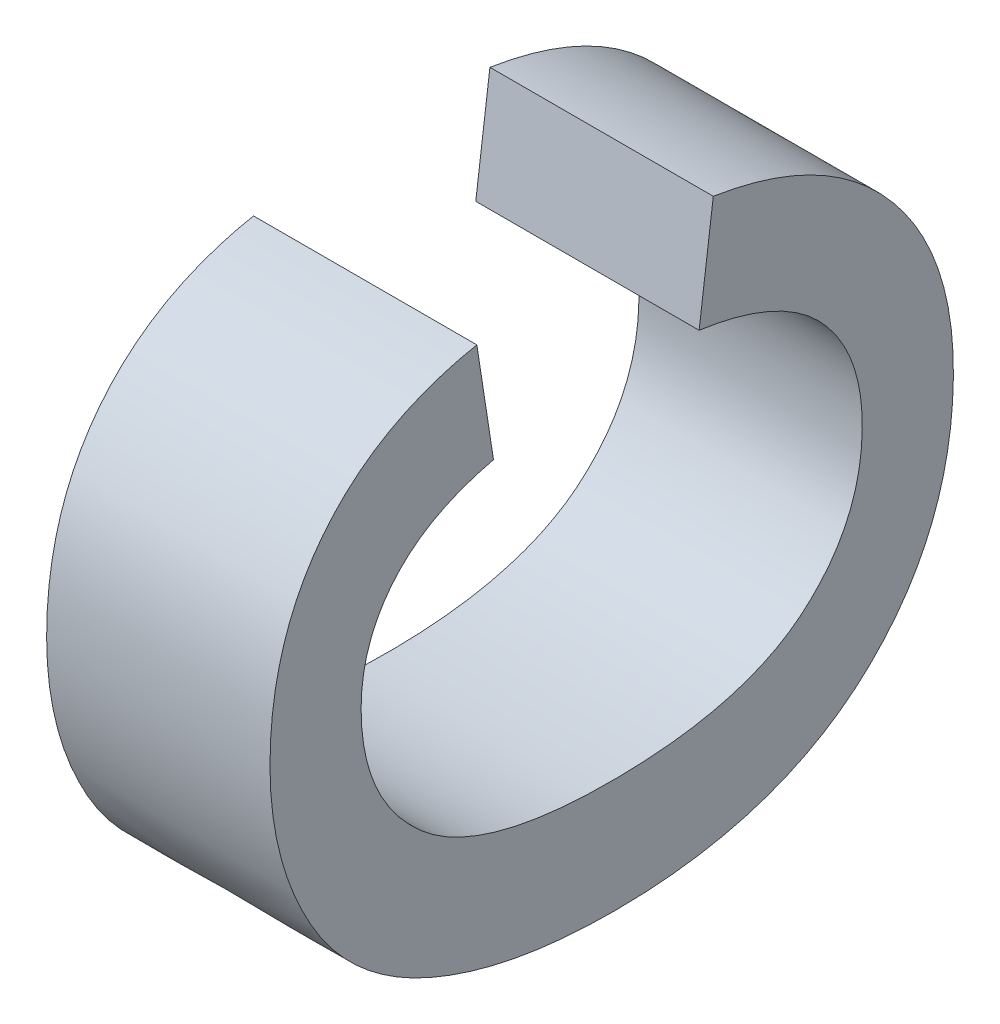
ISO-10303-21;
HEADER;
FILE_DESCRIPTION(('STEP AP214'),'2;1');
FILE_NAME('part.step','',(''),(''),'','','');
FILE_SCHEMA(('AUTOMOTIVE_DESIGN { 1 0 10303 214 1 1 1 1 }'));
ENDSEC;
DATA;
#1=APPLICATION_CONTEXT('core data for automotive mechanical design processes');
#2=APPLICATION_PROTOCOL_DEFINITION('international standard','automotive_design',2000,#1);
#3=PRODUCT_CONTEXT('',#1,'mechanical');
#4=PRODUCT('Part','Part','',(#3));
#5=PRODUCT_RELATED_PRODUCT_CATEGORY('part','',(#4));
#6=PRODUCT_DEFINITION_FORMATION('','',#4);
#7=PRODUCT_DEFINITION_CONTEXT('part definition',#1,'design');
#8=PRODUCT_DEFINITION('design','',#6,#7);
#9=PRODUCT_DEFINITION_SHAPE('','',#8);
#10=(LENGTH_UNIT() NAMED_UNIT(*) SI_UNIT(.MILLI.,.METRE.));
#11=(NAMED_UNIT(*) PLANE_ANGLE_UNIT() SI_UNIT($,.RADIAN.));
#12=(NAMED_UNIT(*) SI_UNIT($,.STERADIAN.) SOLID_ANGLE_UNIT());
#13=UNCERTAINTY_MEASURE_WITH_UNIT(LENGTH_MEASURE(1.E-05),#10,'distance_accuracy_value','');
#14=(GEOMETRIC_REPRESENTATION_CONTEXT(3) GLOBAL_UNCERTAINTY_ASSIGNED_CONTEXT((#13)) GLOBAL_UNIT_ASSIGNED_CONTEXT((#10,
#11,#12)) REPRESENTATION_CONTEXT('',''));
#15=CARTESIAN_POINT('',(0.,0.,0.));
#16=DIRECTION('',(0.,0.,1.));
#17=DIRECTION('',(1.,0.,0.));
#18=AXIS2_PLACEMENT_3D('',#15,#16,#17);
#19=CARTESIAN_POINT('',(4.55229940712924,-40.0797954372396,-8.85443015768737));
#20=DIRECTION('',(-1.,0.,0.));
#21=DIRECTION('',(0.,0.,1.));
#22=AXIS2_PLACEMENT_3D('',#19,#20,#21);
#23=PLANE('',#22);
#24=CARTESIAN_POINT('',(4.55229940712921,-39.8220421062064,-9.00542493597448));
#25=CARTESIAN_POINT('',(4.55229940712921,-39.8461617924584,-9.00914625899622));
#26=CARTESIAN_POINT('',(4.55229940712921,-39.8702814787103,-9.01286758201795));
#27=(BOUNDED_CURVE() B_SPLINE_CURVE(2,(#24,#25,#26),.UNSPECIFIED.,.F.,
.F.) B_SPLINE_CURVE_WITH_KNOTS((3,3),(37.,38.),
.UNSPECIFIED.) CURVE() GEOMETRIC_REPRESENTATION_ITEM() RATIONAL_B_SPLINE_CURVE((1.,1.,1.)) REPRESENTATION_ITEM(''));
#28=CARTESIAN_POINT('',(4.55229940712921,-39.8220421062064,-9.00542493597448));
#29=VERTEX_POINT('',#28);
#30=CARTESIAN_POINT('',(4.55229940712921,-39.8702814787103,-9.01286758201795));
#31=VERTEX_POINT('',#30);
#32=EDGE_CURVE('E87',#29,#31,#27,.T.);
#33=ORIENTED_EDGE('',*,*,#32,.T.);
#34=CARTESIAN_POINT('',(4.55229940712921,-39.8702814787103,-9.01286758201795));
#35=CARTESIAN_POINT('',(4.55229940712921,-39.8771728176395,-8.98337265140124));
#36=CARTESIAN_POINT('',(4.55229940712922,-39.8946768185195,-8.9684873593143));
#37=CARTESIAN_POINT('',(4.55229940712922,-39.9121808193995,-8.95360206722737));
#38=CARTESIAN_POINT('',(4.55229940712922,-39.9369896395444,-8.95360206722737));
#39=CARTESIAN_POINT('',(4.55229940712923,-39.9744785233189,-8.95360206722737));
#40=CARTESIAN_POINT('',(4.55229940712923,-39.997909075678,-8.980478289051));
#41=CARTESIAN_POINT('',(4.55229940712923,-40.0213396280371,-9.00735451087464));
#42=CARTESIAN_POINT('',(4.55229940712923,-40.0213396280371,-9.06551741143657));
#43=CARTESIAN_POINT('',(4.55229940712923,-40.0213396280371,-9.12450727267));
#44=CARTESIAN_POINT('',(4.55229940712923,-39.9987360363495,-9.15124566771505));
#45=CARTESIAN_POINT('',(4.55229940712923,-39.9761324446619,-9.17798406276012));
#46=CARTESIAN_POINT('',(4.55229940712922,-39.9397461751161,-9.17798406276011));
#47=CARTESIAN_POINT('',(4.55229940712922,-39.9105268980565,-9.17798406276012));
#48=CARTESIAN_POINT('',(4.55229940712922,-39.8909554954978,-9.16006658154435));
#49=CARTESIAN_POINT('',(4.55229940712921,-39.871384092939,-9.14214910032859));
#50=CARTESIAN_POINT('',(4.55229940712921,-39.8661466753529,-9.10493587011124));
#51=(BOUNDED_CURVE() B_SPLINE_CURVE(2,(#34,#35,#36,#37,#38,#39,#40,#41,#42,#43,#44,#45,#46,#47,
#48,#49,#50),.UNSPECIFIED.,.F.,.F.) B_SPLINE_CURVE_WITH_KNOTS((3,2,2,2,2,2,2,2,3),(38.,39.,40.,
41.,42.,43.,44.,45.,46.),
.UNSPECIFIED.) CURVE() GEOMETRIC_REPRESENTATION_ITEM() RATIONAL_B_SPLINE_CURVE((1.,1.,1.,1.,1.,
1.,1.,1.,1.,1.,1.,1.,1.,1.,1.,1.,1.)) REPRESENTATION_ITEM(''));
#52=CARTESIAN_POINT('',(4.55229940712921,-39.8661466753529,-9.10493587011124));
#53=VERTEX_POINT('',#52);
#54=EDGE_CURVE('E85',#31,#53,#51,.T.);
#55=ORIENTED_EDGE('',*,*,#54,.T.);
#56=CARTESIAN_POINT('',(4.55229940712921,-39.8661466753529,-9.10493587011124));
#57=CARTESIAN_POINT('',(4.55229940712921,-39.8417513355437,-9.10810588601865));
#58=CARTESIAN_POINT('',(4.5522994071292,-39.8173559957346,-9.11127590192605));
#59=(BOUNDED_CURVE() B_SPLINE_CURVE(2,(#56,#57,#58),.UNSPECIFIED.,.F.,
.F.) B_SPLINE_CURVE_WITH_KNOTS((3,3),(46.,47.),
.UNSPECIFIED.) CURVE() GEOMETRIC_REPRESENTATION_ITEM() RATIONAL_B_SPLINE_CURVE((1.,1.,1.)) REPRESENTATION_ITEM(''));
#60=CARTESIAN_POINT('',(4.5522994071292,-39.8173559957346,-9.11127590192605));
#61=VERTEX_POINT('',#60);
#62=EDGE_CURVE('E76',#53,#61,#59,.T.);
#63=ORIENTED_EDGE('',*,*,#62,.T.);
#64=CARTESIAN_POINT('',(4.5522994071292,-39.8173559957346,-9.11127590192605));
#65=CARTESIAN_POINT('',(4.55229940712921,-39.8253499488924,-9.16172050288735));
#66=CARTESIAN_POINT('',(4.55229940712921,-39.8582905489736,-9.19025064605398));
#67=CARTESIAN_POINT('',(4.55229940712921,-39.8912311490549,-9.21878078922061));
#68=CARTESIAN_POINT('',(4.55229940712922,-39.9391948680017,-9.21878078922061));
#69=CARTESIAN_POINT('',(4.55229940712923,-39.9992873434638,-9.21878078922061));
#70=CARTESIAN_POINT('',(4.55229940712924,-40.0358114397882,-9.17950015732453));
#71=CARTESIAN_POINT('',(4.55229940712924,-40.0723355361127,-9.14021952542843));
#72=CARTESIAN_POINT('',(4.55229940712924,-40.0723355361127,-9.0668956792224));
#73=CARTESIAN_POINT('',(4.55229940712924,-40.0723355361127,-9.01948326738993));
#74=CARTESIAN_POINT('',(4.55229940712924,-40.0566232833543,-8.98392395851557));
#75=CARTESIAN_POINT('',(4.55229940712924,-40.0409110305958,-8.94836464964122));
#76=CARTESIAN_POINT('',(4.55229940712923,-40.008797391186,-8.93058499520405));
#77=CARTESIAN_POINT('',(4.55229940712923,-39.9766837517763,-8.91280534076686));
#78=CARTESIAN_POINT('',(4.55229940712922,-39.9389192144446,-8.91280534076686));
#79=CARTESIAN_POINT('',(4.55229940712922,-39.8912311490549,-8.91280534076686));
#80=CARTESIAN_POINT('',(4.55229940712921,-39.8609092577667,-8.93692502701885));
#81=CARTESIAN_POINT('',(4.55229940712921,-39.8305874001276,-8.96104471327084));
#82=CARTESIAN_POINT('',(4.55229940712921,-39.8220421062064,-9.00542493597448));
#83=(BOUNDED_CURVE() B_SPLINE_CURVE(2,(#64,#65,#66,#67,#68,#69,#70,#71,#72,#73,#74,#75,#76,#77,
#78,#79,#80,#81,#82),.UNSPECIFIED.,.F.,.F.) B_SPLINE_CURVE_WITH_KNOTS((3,2,2,2,2,2,2,2,2,3),
(47.,48.,49.,50.,51.,52.,53.,54.,55.,56.),
.UNSPECIFIED.) CURVE() GEOMETRIC_REPRESENTATION_ITEM() RATIONAL_B_SPLINE_CURVE((1.,1.,1.,1.,1.,
1.,1.,1.,1.,1.,1.,1.,1.,1.,1.,1.,1.,1.,1.)) REPRESENTATION_ITEM(''));
#84=EDGE_CURVE('E11',#61,#29,#83,.T.);
#85=ORIENTED_EDGE('',*,*,#84,.T.);
#86=EDGE_LOOP('',(#33,#55,#63,#85));
#87=FACE_BOUND('',#86,.T.);
#88=ADVANCED_FACE('F16',(#87),#23,.T.);
#89=CARTESIAN_POINT('',(4.65229940712925,-40.0797954372396,-8.85443015768737));
#90=DIRECTION('',(1.,0.,0.));
#91=DIRECTION('',(0.,1.,0.));
#92=AXIS2_PLACEMENT_3D('',#89,#90,#91);
#93=PLANE('',#92);
#94=CARTESIAN_POINT('',(4.65229940712921,-39.8173559957346,-9.11127590192605));
#95=CARTESIAN_POINT('',(4.65229940712921,-39.8253499488924,-9.16172050288735));
#96=CARTESIAN_POINT('',(4.65229940712921,-39.8582905489736,-9.19025064605398));
#97=CARTESIAN_POINT('',(4.65229940712922,-39.8912311490549,-9.21878078922061));
#98=CARTESIAN_POINT('',(4.65229940712922,-39.9391948680017,-9.21878078922062));
#99=CARTESIAN_POINT('',(4.65229940712923,-39.9992873434638,-9.21878078922061));
#100=CARTESIAN_POINT('',(4.65229940712924,-40.0358114397882,-9.17950015732453));
#101=CARTESIAN_POINT('',(4.65229940712924,-40.0723355361127,-9.14021952542844));
#102=CARTESIAN_POINT('',(4.65229940712924,-40.0723355361127,-9.0668956792224));
#103=CARTESIAN_POINT('',(4.65229940712924,-40.0723355361127,-9.01948326738993));
#104=CARTESIAN_POINT('',(4.65229940712924,-40.0566232833542,-8.98392395851557));
#105=CARTESIAN_POINT('',(4.65229940712924,-40.0409110305958,-8.94836464964122));
#106=CARTESIAN_POINT('',(4.65229940712924,-40.008797391186,-8.93058499520405));
#107=CARTESIAN_POINT('',(4.65229940712923,-39.9766837517762,-8.91280534076686));
#108=CARTESIAN_POINT('',(4.65229940712923,-39.9389192144445,-8.91280534076686));
#109=CARTESIAN_POINT('',(4.65229940712922,-39.8912311490549,-8.91280534076686));
#110=CARTESIAN_POINT('',(4.65229940712921,-39.8609092577667,-8.93692502701885));
#111=CARTESIAN_POINT('',(4.65229940712921,-39.8305874001276,-8.96104471327084));
#112=CARTESIAN_POINT('',(4.65229940712921,-39.8220421062064,-9.00542493597448));
#113=(BOUNDED_CURVE() B_SPLINE_CURVE(2,(#94,#95,#96,#97,#98,#99,#100,#101,#102,#103,#104,#105,
#106,#107,#108,#109,#110,#111,#112),.UNSPECIFIED.,.F.,.F.) B_SPLINE_CURVE_WITH_KNOTS((3,2,2,2,2,
2,2,2,2,3),(47.,48.,49.,50.,51.,52.,53.,54.,55.,56.),
.UNSPECIFIED.) CURVE() GEOMETRIC_REPRESENTATION_ITEM() RATIONAL_B_SPLINE_CURVE((1.,1.,1.,1.,1.,
1.,1.,1.,1.,1.,1.,1.,1.,1.,1.,1.,1.,1.,1.)) REPRESENTATION_ITEM(''));
#114=CARTESIAN_POINT('',(4.65229940712921,-39.8173559957346,-9.11127590192605));
#115=VERTEX_POINT('',#114);
#116=CARTESIAN_POINT('',(4.65229940712921,-39.8220421062064,-9.00542493597448));
#117=VERTEX_POINT('',#116);
#118=EDGE_CURVE('E31',#115,#117,#113,.T.);
#119=ORIENTED_EDGE('',*,*,#118,.F.);
#120=CARTESIAN_POINT('',(4.65229940712921,-39.8661466753528,-9.10493587011124));
#121=CARTESIAN_POINT('',(4.65229940712921,-39.8417513355437,-9.10810588601865));
#122=CARTESIAN_POINT('',(4.65229940712921,-39.8173559957346,-9.11127590192605));
#123=(BOUNDED_CURVE() B_SPLINE_CURVE(2,(#120,#121,#122),.UNSPECIFIED.,.F.,
.F.) B_SPLINE_CURVE_WITH_KNOTS((3,3),(46.,47.),
.UNSPECIFIED.) CURVE() GEOMETRIC_REPRESENTATION_ITEM() RATIONAL_B_SPLINE_CURVE((1.,1.,1.)) REPRESENTATION_ITEM(''));
#124=CARTESIAN_POINT('',(4.65229940712921,-39.8661466753528,-9.10493587011124));
#125=VERTEX_POINT('',#124);
#126=EDGE_CURVE('E69',#125,#115,#123,.T.);
#127=ORIENTED_EDGE('',*,*,#126,.F.);
#128=CARTESIAN_POINT('',(4.65229940712921,-39.8702814787103,-9.01286758201796));
#129=CARTESIAN_POINT('',(4.65229940712922,-39.8771728176395,-8.98337265140124));
#130=CARTESIAN_POINT('',(4.65229940712922,-39.8946768185195,-8.96848735931431));
#131=CARTESIAN_POINT('',(4.65229940712922,-39.9121808193995,-8.95360206722737));
#132=CARTESIAN_POINT('',(4.65229940712922,-39.9369896395444,-8.95360206722737));
#133=CARTESIAN_POINT('',(4.65229940712923,-39.9744785233189,-8.95360206722737));
#134=CARTESIAN_POINT('',(4.65229940712923,-39.997909075678,-8.980478289051));
#135=CARTESIAN_POINT('',(4.65229940712924,-40.021339628037,-9.00735451087465));
#136=CARTESIAN_POINT('',(4.65229940712924,-40.021339628037,-9.06551741143657));
#137=CARTESIAN_POINT('',(4.65229940712924,-40.021339628037,-9.12450727267));
#138=CARTESIAN_POINT('',(4.65229940712923,-39.9987360363495,-9.15124566771505));
#139=CARTESIAN_POINT('',(4.65229940712923,-39.9761324446619,-9.17798406276012));
#140=CARTESIAN_POINT('',(4.65229940712922,-39.9397461751161,-9.17798406276011));
#141=CARTESIAN_POINT('',(4.65229940712922,-39.9105268980565,-9.17798406276012));
#142=CARTESIAN_POINT('',(4.65229940712922,-39.8909554954977,-9.16006658154435));
#143=CARTESIAN_POINT('',(4.65229940712921,-39.871384092939,-9.14214910032859));
#144=CARTESIAN_POINT('',(4.65229940712921,-39.8661466753528,-9.10493587011124));
#145=(BOUNDED_CURVE() B_SPLINE_CURVE(2,(#128,#129,#130,#131,#132,#133,#134,#135,#136,#137,#138,
#139,#140,#141,#142,#143,#144),.UNSPECIFIED.,.F.,.F.) B_SPLINE_CURVE_WITH_KNOTS((3,2,2,2,2,2,2,
2,3),(38.,39.,40.,41.,42.,43.,44.,45.,46.),
.UNSPECIFIED.) CURVE() GEOMETRIC_REPRESENTATION_ITEM() RATIONAL_B_SPLINE_CURVE((1.,1.,1.,1.,1.,
1.,1.,1.,1.,1.,1.,1.,1.,1.,1.,1.,1.)) REPRESENTATION_ITEM(''));
#146=CARTESIAN_POINT('',(4.65229940712921,-39.8702814787103,-9.01286758201796));
#147=VERTEX_POINT('',#146);
#148=EDGE_CURVE('E93',#147,#125,#145,.T.);
#149=ORIENTED_EDGE('',*,*,#148,.F.);
#150=CARTESIAN_POINT('',(4.65229940712921,-39.8220421062064,-9.00542493597448));
#151=CARTESIAN_POINT('',(4.65229940712921,-39.8461617924583,-9.00914625899622));
#152=CARTESIAN_POINT('',(4.65229940712921,-39.8702814787103,-9.01286758201796));
#153=(BOUNDED_CURVE() B_SPLINE_CURVE(2,(#150,#151,#152),.UNSPECIFIED.,.F.,
.F.) B_SPLINE_CURVE_WITH_KNOTS((3,3),(37.,38.),
.UNSPECIFIED.) CURVE() GEOMETRIC_REPRESENTATION_ITEM() RATIONAL_B_SPLINE_CURVE((1.,1.,1.)) REPRESENTATION_ITEM(''));
#154=EDGE_CURVE('E112',#117,#147,#153,.T.);
#155=ORIENTED_EDGE('',*,*,#154,.F.);
#156=EDGE_LOOP('',(#119,#127,#149,#155));
#157=FACE_BOUND('',#156,.T.);
#158=ADVANCED_FACE('F175',(#157),#93,.T.);
#159=CARTESIAN_POINT('',(4.65229940712921,-39.8173559957346,-9.11127590192605));
#160=CARTESIAN_POINT('',(4.5522994071292,-39.8173559957346,-9.11127590192605));
#161=CARTESIAN_POINT('',(4.65229940712921,-39.8253499488924,-9.16172050288735));
#162=CARTESIAN_POINT('',(4.55229940712921,-39.8253499488924,-9.16172050288735));
#163=CARTESIAN_POINT('',(4.65229940712921,-39.8582905489736,-9.19025064605398));
#164=CARTESIAN_POINT('',(4.55229940712921,-39.8582905489736,-9.19025064605398));
#165=CARTESIAN_POINT('',(4.65229940712922,-39.8912311490549,-9.21878078922061));
#166=CARTESIAN_POINT('',(4.55229940712921,-39.8912311490549,-9.21878078922061));
#167=CARTESIAN_POINT('',(4.65229940712922,-39.9391948680017,-9.21878078922062));
#168=CARTESIAN_POINT('',(4.55229940712922,-39.9391948680017,-9.21878078922061));
#169=CARTESIAN_POINT('',(4.65229940712923,-39.9992873434638,-9.21878078922061));
#170=CARTESIAN_POINT('',(4.55229940712923,-39.9992873434638,-9.21878078922061));
#171=CARTESIAN_POINT('',(4.65229940712924,-40.0358114397882,-9.17950015732453));
#172=CARTESIAN_POINT('',(4.55229940712924,-40.0358114397882,-9.17950015732453));
#173=CARTESIAN_POINT('',(4.65229940712924,-40.0723355361127,-9.14021952542844));
#174=CARTESIAN_POINT('',(4.55229940712924,-40.0723355361127,-9.14021952542843));
#175=CARTESIAN_POINT('',(4.65229940712924,-40.0723355361127,-9.0668956792224));
#176=CARTESIAN_POINT('',(4.55229940712924,-40.0723355361127,-9.0668956792224));
#177=CARTESIAN_POINT('',(4.65229940712924,-40.0723355361127,-9.01948326738993));
#178=CARTESIAN_POINT('',(4.55229940712924,-40.0723355361127,-9.01948326738993));
#179=CARTESIAN_POINT('',(4.65229940712924,-40.0566232833542,-8.98392395851557));
#180=CARTESIAN_POINT('',(4.55229940712924,-40.0566232833543,-8.98392395851557));
#181=CARTESIAN_POINT('',(4.65229940712924,-40.0409110305958,-8.94836464964122));
#182=CARTESIAN_POINT('',(4.55229940712924,-40.0409110305958,-8.94836464964122));
#183=CARTESIAN_POINT('',(4.65229940712924,-40.008797391186,-8.93058499520405));
#184=CARTESIAN_POINT('',(4.55229940712923,-40.008797391186,-8.93058499520405));
#185=CARTESIAN_POINT('',(4.65229940712923,-39.9766837517762,-8.91280534076686));
#186=CARTESIAN_POINT('',(4.55229940712923,-39.9766837517763,-8.91280534076686));
#187=CARTESIAN_POINT('',(4.65229940712923,-39.9389192144445,-8.91280534076686));
#188=CARTESIAN_POINT('',(4.55229940712922,-39.9389192144446,-8.91280534076686));
#189=CARTESIAN_POINT('',(4.65229940712922,-39.8912311490549,-8.91280534076686));
#190=CARTESIAN_POINT('',(4.55229940712922,-39.8912311490549,-8.91280534076686));
#191=CARTESIAN_POINT('',(4.65229940712921,-39.8609092577667,-8.93692502701885));
#192=CARTESIAN_POINT('',(4.55229940712921,-39.8609092577667,-8.93692502701885));
#193=CARTESIAN_POINT('',(4.65229940712921,-39.8305874001276,-8.96104471327084));
#194=CARTESIAN_POINT('',(4.55229940712921,-39.8305874001276,-8.96104471327084));
#195=CARTESIAN_POINT('',(4.65229940712921,-39.8220421062064,-9.00542493597448));
#196=CARTESIAN_POINT('',(4.55229940712921,-39.8220421062064,-9.00542493597448));
#197=(BOUNDED_SURFACE() B_SPLINE_SURFACE(2,1,((#159,#160),(#161,#162),(#163,#164),(#165,#166),
(#167,#168),(#169,#170),(#171,#172),(#173,#174),(#175,#176),(#177,#178),(#179,#180),(#181,#182),
(#183,#184),(#185,#186),(#187,#188),(#189,#190),(#191,#192),(#193,#194),(#195,#196)),
.UNSPECIFIED.,.F.,.F.,.F.) B_SPLINE_SURFACE_WITH_KNOTS((3,2,2,2,2,2,2,2,2,3),(2,2),(47.,48.,49.,
50.,51.,52.,53.,54.,55.,56.),(0.,0.1),
.UNSPECIFIED.) GEOMETRIC_REPRESENTATION_ITEM() RATIONAL_B_SPLINE_SURFACE(((1.,1.),(1.,1.),(1.,
1.),(1.,1.),(1.,1.),(1.,1.),(1.,1.),(1.,1.),(1.,1.),(1.,1.),(1.,1.),(1.,1.),(1.,1.),(1.,1.),(1.,
1.),(1.,1.),(1.,1.),(1.,1.),(1.,1.))) REPRESENTATION_ITEM('') SURFACE());
#198=CARTESIAN_POINT('',(4.65229940712921,-39.8220421062064,-9.00542493597448));
#199=CARTESIAN_POINT('',(4.55229940712921,-39.8220421062064,-9.00542493597448));
#200=(BOUNDED_CURVE() B_SPLINE_CURVE(1,(#198,#199),.UNSPECIFIED.,.F.,
.F.) B_SPLINE_CURVE_WITH_KNOTS((2,2),(0.,0.1),
.UNSPECIFIED.) CURVE() GEOMETRIC_REPRESENTATION_ITEM() RATIONAL_B_SPLINE_CURVE((1.,1.)) REPRESENTATION_ITEM(''));
#201=EDGE_CURVE('E99',#117,#29,#200,.T.);
#202=CARTESIAN_POINT('',(4.65229940712921,-39.8173559957346,-9.11127590192605));
#203=CARTESIAN_POINT('',(4.5522994071292,-39.8173559957346,-9.11127590192605));
#204=(BOUNDED_CURVE() B_SPLINE_CURVE(1,(#202,#203),.UNSPECIFIED.,.F.,
.F.) B_SPLINE_CURVE_WITH_KNOTS((2,2),(0.,0.1),
.UNSPECIFIED.) CURVE() GEOMETRIC_REPRESENTATION_ITEM() RATIONAL_B_SPLINE_CURVE((1.,1.)) REPRESENTATION_ITEM(''));
#205=EDGE_CURVE('E22',#115,#61,#204,.T.);
#206=ORIENTED_EDGE('',*,*,#118,.T.);
#207=ORIENTED_EDGE('',*,*,#201,.T.);
#208=ORIENTED_EDGE('',*,*,#84,.F.);
#209=ORIENTED_EDGE('',*,*,#205,.F.);
#210=EDGE_LOOP('',(#206,#207,#208,#209));
#211=FACE_BOUND('',#210,.T.);
#212=ADVANCED_FACE('F176',(#211),#197,.T.);
#213=CARTESIAN_POINT('',(4.65229940712921,-39.8661466753528,-9.10493587011124));
#214=CARTESIAN_POINT('',(4.55229940712921,-39.8661466753529,-9.10493587011124));
#215=CARTESIAN_POINT('',(4.65229940712921,-39.8417513355437,-9.10810588601865));
#216=CARTESIAN_POINT('',(4.55229940712921,-39.8417513355437,-9.10810588601865));
#217=CARTESIAN_POINT('',(4.65229940712921,-39.8173559957346,-9.11127590192605));
#218=CARTESIAN_POINT('',(4.5522994071292,-39.8173559957346,-9.11127590192605));
#219=(BOUNDED_SURFACE() B_SPLINE_SURFACE(2,1,((#213,#214),(#215,#216),(#217,#218)),
.UNSPECIFIED.,.F.,.F.,.F.) B_SPLINE_SURFACE_WITH_KNOTS((3,3),(2,2),(46.,47.),(0.,0.1),
.UNSPECIFIED.) GEOMETRIC_REPRESENTATION_ITEM() RATIONAL_B_SPLINE_SURFACE(((1.,1.),(1.,1.),(1.,1.))) REPRESENTATION_ITEM('') SURFACE());
#220=CARTESIAN_POINT('',(4.65229940712921,-39.8661466753528,-9.10493587011124));
#221=CARTESIAN_POINT('',(4.55229940712921,-39.8661466753529,-9.10493587011124));
#222=(BOUNDED_CURVE() B_SPLINE_CURVE(1,(#220,#221),.UNSPECIFIED.,.F.,
.F.) B_SPLINE_CURVE_WITH_KNOTS((2,2),(0.,0.1),
.UNSPECIFIED.) CURVE() GEOMETRIC_REPRESENTATION_ITEM() RATIONAL_B_SPLINE_CURVE((1.,1.)) REPRESENTATION_ITEM(''));
#223=EDGE_CURVE('E79',#125,#53,#222,.T.);
#224=ORIENTED_EDGE('',*,*,#126,.T.);
#225=ORIENTED_EDGE('',*,*,#205,.T.);
#226=ORIENTED_EDGE('',*,*,#62,.F.);
#227=ORIENTED_EDGE('',*,*,#223,.F.);
#228=EDGE_LOOP('',(#224,#225,#226,#227));
#229=FACE_BOUND('',#228,.T.);
#230=ADVANCED_FACE('F18',(#229),#219,.T.);
#231=CARTESIAN_POINT('',(4.65229940712921,-39.8702814787103,-9.01286758201796));
#232=CARTESIAN_POINT('',(4.55229940712921,-39.8702814787103,-9.01286758201795));
#233=CARTESIAN_POINT('',(4.65229940712922,-39.8771728176395,-8.98337265140124));
#234=CARTESIAN_POINT('',(4.55229940712921,-39.8771728176395,-8.98337265140124));
#235=CARTESIAN_POINT('',(4.65229940712922,-39.8946768185195,-8.96848735931431));
#236=CARTESIAN_POINT('',(4.55229940712922,-39.8946768185195,-8.9684873593143));
#237=CARTESIAN_POINT('',(4.65229940712922,-39.9121808193995,-8.95360206722737));
#238=CARTESIAN_POINT('',(4.55229940712922,-39.9121808193995,-8.95360206722737));
#239=CARTESIAN_POINT('',(4.65229940712922,-39.9369896395444,-8.95360206722737));
#240=CARTESIAN_POINT('',(4.55229940712922,-39.9369896395444,-8.95360206722737));
#241=CARTESIAN_POINT('',(4.65229940712923,-39.9744785233189,-8.95360206722737));
#242=CARTESIAN_POINT('',(4.55229940712923,-39.9744785233189,-8.95360206722737));
#243=CARTESIAN_POINT('',(4.65229940712923,-39.997909075678,-8.980478289051));
#244=CARTESIAN_POINT('',(4.55229940712923,-39.997909075678,-8.980478289051));
#245=CARTESIAN_POINT('',(4.65229940712924,-40.021339628037,-9.00735451087465));
#246=CARTESIAN_POINT('',(4.55229940712923,-40.0213396280371,-9.00735451087464));
#247=CARTESIAN_POINT('',(4.65229940712924,-40.021339628037,-9.06551741143657));
#248=CARTESIAN_POINT('',(4.55229940712923,-40.0213396280371,-9.06551741143657));
#249=CARTESIAN_POINT('',(4.65229940712924,-40.021339628037,-9.12450727267));
#250=CARTESIAN_POINT('',(4.55229940712923,-40.0213396280371,-9.12450727267));
#251=CARTESIAN_POINT('',(4.65229940712923,-39.9987360363495,-9.15124566771505));
#252=CARTESIAN_POINT('',(4.55229940712923,-39.9987360363495,-9.15124566771505));
#253=CARTESIAN_POINT('',(4.65229940712923,-39.9761324446619,-9.17798406276012));
#254=CARTESIAN_POINT('',(4.55229940712923,-39.9761324446619,-9.17798406276012));
#255=CARTESIAN_POINT('',(4.65229940712922,-39.9397461751161,-9.17798406276011));
#256=CARTESIAN_POINT('',(4.55229940712922,-39.9397461751161,-9.17798406276011));
#257=CARTESIAN_POINT('',(4.65229940712922,-39.9105268980565,-9.17798406276012));
#258=CARTESIAN_POINT('',(4.55229940712922,-39.9105268980565,-9.17798406276012));
#259=CARTESIAN_POINT('',(4.65229940712922,-39.8909554954977,-9.16006658154435));
#260=CARTESIAN_POINT('',(4.55229940712922,-39.8909554954978,-9.16006658154435));
#261=CARTESIAN_POINT('',(4.65229940712921,-39.871384092939,-9.14214910032859));
#262=CARTESIAN_POINT('',(4.55229940712921,-39.871384092939,-9.14214910032859));
#263=CARTESIAN_POINT('',(4.65229940712921,-39.8661466753528,-9.10493587011124));
#264=CARTESIAN_POINT('',(4.55229940712921,-39.8661466753529,-9.10493587011124));
#265=(BOUNDED_SURFACE() B_SPLINE_SURFACE(2,1,((#231,#232),(#233,#234),(#235,#236),(#237,#238),
(#239,#240),(#241,#242),(#243,#244),(#245,#246),(#247,#248),(#249,#250),(#251,#252),(#253,#254),
(#255,#256),(#257,#258),(#259,#260),(#261,#262),(#263,#264)),.UNSPECIFIED.,.F.,.F.,
.F.) B_SPLINE_SURFACE_WITH_KNOTS((3,2,2,2,2,2,2,2,3),(2,2),(38.,39.,40.,41.,42.,43.,44.,45.,
46.),(0.,0.1),.UNSPECIFIED.) GEOMETRIC_REPRESENTATION_ITEM() RATIONAL_B_SPLINE_SURFACE(((1.,1.),
(1.,1.),(1.,1.),(1.,1.),(1.,1.),(1.,1.),(1.,1.),(1.,1.),(1.,1.),(1.,1.),(1.,1.),(1.,1.),(1.,1.),
(1.,1.),(1.,1.),(1.,1.),(1.,1.))) REPRESENTATION_ITEM('') SURFACE());
#266=CARTESIAN_POINT('',(4.65229940712921,-39.8702814787103,-9.01286758201796));
#267=CARTESIAN_POINT('',(4.55229940712921,-39.8702814787103,-9.01286758201795));
#268=(BOUNDED_CURVE() B_SPLINE_CURVE(1,(#266,#267),.UNSPECIFIED.,.F.,
.F.) B_SPLINE_CURVE_WITH_KNOTS((2,2),(0.,0.1),
.UNSPECIFIED.) CURVE() GEOMETRIC_REPRESENTATION_ITEM() RATIONAL_B_SPLINE_CURVE((1.,1.)) REPRESENTATION_ITEM(''));
#269=EDGE_CURVE('E120',#147,#31,#268,.T.);
#270=ORIENTED_EDGE('',*,*,#148,.T.);
#271=ORIENTED_EDGE('',*,*,#223,.T.);
#272=ORIENTED_EDGE('',*,*,#54,.F.);
#273=ORIENTED_EDGE('',*,*,#269,.F.);
#274=EDGE_LOOP('',(#270,#271,#272,#273));
#275=FACE_BOUND('',#274,.T.);
#276=ADVANCED_FACE('F92',(#275),#265,.T.);
#277=CARTESIAN_POINT('',(4.65229940712921,-39.8220421062064,-9.00542493597448));
#278=CARTESIAN_POINT('',(4.55229940712921,-39.8220421062064,-9.00542493597448));
#279=CARTESIAN_POINT('',(4.65229940712921,-39.8461617924583,-9.00914625899622));
#280=CARTESIAN_POINT('',(4.55229940712921,-39.8461617924584,-9.00914625899622));
#281=CARTESIAN_POINT('',(4.65229940712921,-39.8702814787103,-9.01286758201796));
#282=CARTESIAN_POINT('',(4.55229940712921,-39.8702814787103,-9.01286758201795));
#283=(BOUNDED_SURFACE() B_SPLINE_SURFACE(2,1,((#277,#278),(#279,#280),(#281,#282)),
.UNSPECIFIED.,.F.,.F.,.F.) B_SPLINE_SURFACE_WITH_KNOTS((3,3),(2,2),(37.,38.),(0.,0.1),
.UNSPECIFIED.) GEOMETRIC_REPRESENTATION_ITEM() RATIONAL_B_SPLINE_SURFACE(((1.,1.),(1.,1.),(1.,1.))) REPRESENTATION_ITEM('') SURFACE());
#284=ORIENTED_EDGE('',*,*,#154,.T.);
#285=ORIENTED_EDGE('',*,*,#269,.T.);
#286=ORIENTED_EDGE('',*,*,#32,.F.);
#287=ORIENTED_EDGE('',*,*,#201,.F.);
#288=EDGE_LOOP('',(#284,#285,#286,#287));
#289=FACE_BOUND('',#288,.T.);
#290=ADVANCED_FACE('F172',(#289),#283,.T.);
#291=CLOSED_SHELL('',(#88,#158,#212,#230,#276,#290));
#292=MANIFOLD_SOLID_BREP('B1',#291);
#293=ADVANCED_BREP_SHAPE_REPRESENTATION('',(#18,#292),#14);
#294=SHAPE_DEFINITION_REPRESENTATION(#9,#293);
ENDSEC;
END-ISO-10303-21;
